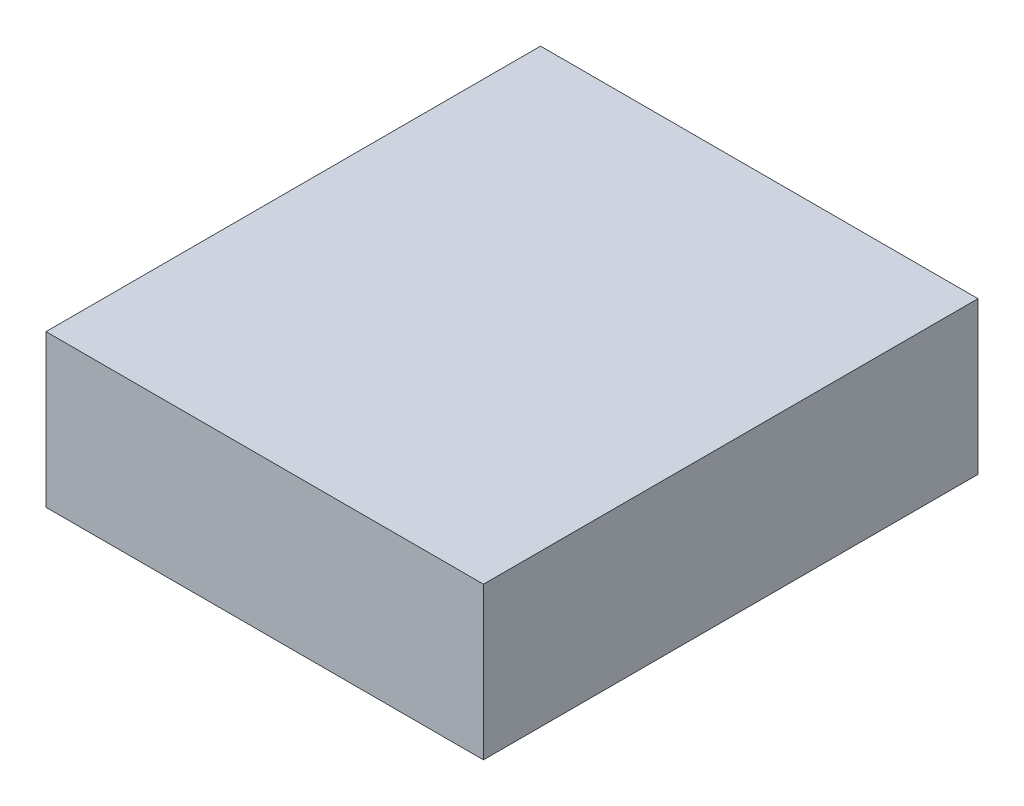
ISO-10303-21;
HEADER;
FILE_DESCRIPTION(('STEP AP214'),'2;1');
FILE_NAME('part.step','',(''),(''),'','','');
FILE_SCHEMA(('AUTOMOTIVE_DESIGN { 1 0 10303 214 1 1 1 1 }'));
ENDSEC;
DATA;
#1=APPLICATION_CONTEXT('core data for automotive mechanical design processes');
#2=APPLICATION_PROTOCOL_DEFINITION('international standard','automotive_design',2000,#1);
#3=PRODUCT_CONTEXT('',#1,'mechanical');
#4=PRODUCT('Part','Part','',(#3));
#5=PRODUCT_RELATED_PRODUCT_CATEGORY('part','',(#4));
#6=PRODUCT_DEFINITION_FORMATION('','',#4);
#7=PRODUCT_DEFINITION_CONTEXT('part definition',#1,'design');
#8=PRODUCT_DEFINITION('design','',#6,#7);
#9=PRODUCT_DEFINITION_SHAPE('','',#8);
#10=(LENGTH_UNIT() NAMED_UNIT(*) SI_UNIT(.MILLI.,.METRE.));
#11=(NAMED_UNIT(*) PLANE_ANGLE_UNIT() SI_UNIT($,.RADIAN.));
#12=(NAMED_UNIT(*) SI_UNIT($,.STERADIAN.) SOLID_ANGLE_UNIT());
#13=UNCERTAINTY_MEASURE_WITH_UNIT(LENGTH_MEASURE(1.E-05),#10,'distance_accuracy_value','');
#14=(GEOMETRIC_REPRESENTATION_CONTEXT(3) GLOBAL_UNCERTAINTY_ASSIGNED_CONTEXT((#13)) GLOBAL_UNIT_ASSIGNED_CONTEXT((#10,
#11,#12)) REPRESENTATION_CONTEXT('',''));
#15=CARTESIAN_POINT('',(0.,0.,0.));
#16=DIRECTION('',(0.,0.,1.));
#17=DIRECTION('',(1.,0.,0.));
#18=AXIS2_PLACEMENT_3D('',#15,#16,#17);
#19=CARTESIAN_POINT('',(0.,8.,0.));
#20=DIRECTION('',(1.,0.,0.));
#21=DIRECTION('',(0.,0.,-1.));
#22=AXIS2_PLACEMENT_3D('',#19,#20,#21);
#23=PLANE('',#22);
#24=DIRECTION('',(0.,0.,1.));
#25=VECTOR('',#24,1.);
#26=CARTESIAN_POINT('',(0.,0.,0.));
#27=LINE('',#26,#25);
#28=CARTESIAN_POINT('',(0.,0.,-26.));
#29=VERTEX_POINT('',#28);
#30=CARTESIAN_POINT('',(0.,0.,0.));
#31=VERTEX_POINT('',#30);
#32=EDGE_CURVE('E94',#29,#31,#27,.T.);
#33=ORIENTED_EDGE('',*,*,#32,.T.);
#34=DIRECTION('',(0.,-1.,0.));
#35=VECTOR('',#34,1.);
#36=CARTESIAN_POINT('',(0.,8.,0.));
#37=LINE('',#36,#35);
#38=CARTESIAN_POINT('',(0.,8.,0.));
#39=VERTEX_POINT('',#38);
#40=EDGE_CURVE('E11',#39,#31,#37,.T.);
#41=ORIENTED_EDGE('',*,*,#40,.F.);
#42=DIRECTION('',(0.,0.,1.));
#43=VECTOR('',#42,1.);
#44=CARTESIAN_POINT('',(0.,8.,0.));
#45=LINE('',#44,#43);
#46=CARTESIAN_POINT('',(0.,8.,-26.));
#47=VERTEX_POINT('',#46);
#48=EDGE_CURVE('E82',#47,#39,#45,.T.);
#49=ORIENTED_EDGE('',*,*,#48,.F.);
#50=DIRECTION('',(0.,-1.,0.));
#51=VECTOR('',#50,1.);
#52=CARTESIAN_POINT('',(0.,8.,-26.));
#53=LINE('',#52,#51);
#54=EDGE_CURVE('E90',#47,#29,#53,.T.);
#55=ORIENTED_EDGE('',*,*,#54,.T.);
#56=EDGE_LOOP('',(#33,#41,#49,#55));
#57=FACE_BOUND('',#56,.T.);
#58=ADVANCED_FACE('F31',(#57),#23,.F.);
#59=CARTESIAN_POINT('',(0.,8.,0.));
#60=DIRECTION('',(0.,0.,-1.));
#61=DIRECTION('',(-1.,0.,0.));
#62=AXIS2_PLACEMENT_3D('',#59,#60,#61);
#63=PLANE('',#62);
#64=DIRECTION('',(1.,0.,0.));
#65=VECTOR('',#64,1.);
#66=CARTESIAN_POINT('',(0.,0.,0.));
#67=LINE('',#66,#65);
#68=CARTESIAN_POINT('',(23.,0.,0.));
#69=VERTEX_POINT('',#68);
#70=EDGE_CURVE('E86',#31,#69,#67,.T.);
#71=ORIENTED_EDGE('',*,*,#70,.T.);
#72=DIRECTION('',(0.,-1.,0.));
#73=VECTOR('',#72,1.);
#74=CARTESIAN_POINT('',(23.,8.,0.));
#75=LINE('',#74,#73);
#76=CARTESIAN_POINT('',(23.,8.,0.));
#77=VERTEX_POINT('',#76);
#78=EDGE_CURVE('E39',#77,#69,#75,.T.);
#79=ORIENTED_EDGE('',*,*,#78,.F.);
#80=DIRECTION('',(1.,0.,0.));
#81=VECTOR('',#80,1.);
#82=CARTESIAN_POINT('',(0.,8.,0.));
#83=LINE('',#82,#81);
#84=EDGE_CURVE('E77',#39,#77,#83,.T.);
#85=ORIENTED_EDGE('',*,*,#84,.F.);
#86=ORIENTED_EDGE('',*,*,#40,.T.);
#87=EDGE_LOOP('',(#71,#79,#85,#86));
#88=FACE_BOUND('',#87,.T.);
#89=ADVANCED_FACE('F85',(#88),#63,.F.);
#90=CARTESIAN_POINT('',(23.,8.,0.));
#91=DIRECTION('',(-1.,0.,0.));
#92=DIRECTION('',(0.,0.,1.));
#93=AXIS2_PLACEMENT_3D('',#90,#91,#92);
#94=PLANE('',#93);
#95=DIRECTION('',(0.,0.,-1.));
#96=VECTOR('',#95,1.);
#97=CARTESIAN_POINT('',(23.,0.,0.));
#98=LINE('',#97,#96);
#99=CARTESIAN_POINT('',(23.,0.,-26.));
#100=VERTEX_POINT('',#99);
#101=EDGE_CURVE('E64',#69,#100,#98,.T.);
#102=ORIENTED_EDGE('',*,*,#101,.T.);
#103=DIRECTION('',(0.,-1.,0.));
#104=VECTOR('',#103,1.);
#105=CARTESIAN_POINT('',(23.,8.,-26.));
#106=LINE('',#105,#104);
#107=CARTESIAN_POINT('',(23.,8.,-26.));
#108=VERTEX_POINT('',#107);
#109=EDGE_CURVE('E87',#108,#100,#106,.T.);
#110=ORIENTED_EDGE('',*,*,#109,.F.);
#111=DIRECTION('',(0.,0.,-1.));
#112=VECTOR('',#111,1.);
#113=CARTESIAN_POINT('',(23.,8.,0.));
#114=LINE('',#113,#112);
#115=EDGE_CURVE('E80',#77,#108,#114,.T.);
#116=ORIENTED_EDGE('',*,*,#115,.F.);
#117=ORIENTED_EDGE('',*,*,#78,.T.);
#118=EDGE_LOOP('',(#102,#110,#116,#117));
#119=FACE_BOUND('',#118,.T.);
#120=ADVANCED_FACE('F88',(#119),#94,.F.);
#121=CARTESIAN_POINT('',(0.,8.,-26.));
#122=DIRECTION('',(0.,0.,1.));
#123=DIRECTION('',(1.,0.,0.));
#124=AXIS2_PLACEMENT_3D('',#121,#122,#123);
#125=PLANE('',#124);
#126=DIRECTION('',(-1.,0.,0.));
#127=VECTOR('',#126,1.);
#128=CARTESIAN_POINT('',(0.,0.,-26.));
#129=LINE('',#128,#127);
#130=EDGE_CURVE('E70',#100,#29,#129,.T.);
#131=ORIENTED_EDGE('',*,*,#130,.T.);
#132=ORIENTED_EDGE('',*,*,#54,.F.);
#133=DIRECTION('',(-1.,0.,0.));
#134=VECTOR('',#133,1.);
#135=CARTESIAN_POINT('',(0.,8.,-26.));
#136=LINE('',#135,#134);
#137=EDGE_CURVE('E47',#108,#47,#136,.T.);
#138=ORIENTED_EDGE('',*,*,#137,.F.);
#139=ORIENTED_EDGE('',*,*,#109,.T.);
#140=EDGE_LOOP('',(#131,#132,#138,#139));
#141=FACE_BOUND('',#140,.T.);
#142=ADVANCED_FACE('F101',(#141),#125,.F.);
#143=CARTESIAN_POINT('',(0.,8.,-26.));
#144=DIRECTION('',(0.,-1.,0.));
#145=DIRECTION('',(0.,0.,-1.));
#146=AXIS2_PLACEMENT_3D('',#143,#144,#145);
#147=PLANE('',#146);
#148=ORIENTED_EDGE('',*,*,#48,.T.);
#149=ORIENTED_EDGE('',*,*,#84,.T.);
#150=ORIENTED_EDGE('',*,*,#115,.T.);
#151=ORIENTED_EDGE('',*,*,#137,.T.);
#152=EDGE_LOOP('',(#148,#149,#150,#151));
#153=FACE_BOUND('',#152,.T.);
#154=ADVANCED_FACE('F78',(#153),#147,.F.);
#155=CARTESIAN_POINT('',(0.,0.,-26.));
#156=DIRECTION('',(0.,-1.,0.));
#157=DIRECTION('',(0.,0.,-1.));
#158=AXIS2_PLACEMENT_3D('',#155,#156,#157);
#159=PLANE('',#158);
#160=ORIENTED_EDGE('',*,*,#32,.F.);
#161=ORIENTED_EDGE('',*,*,#130,.F.);
#162=ORIENTED_EDGE('',*,*,#101,.F.);
#163=ORIENTED_EDGE('',*,*,#70,.F.);
#164=EDGE_LOOP('',(#160,#161,#162,#163));
#165=FACE_BOUND('',#164,.T.);
#166=ADVANCED_FACE('F104',(#165),#159,.T.);
#167=CLOSED_SHELL('',(#58,#89,#120,#142,#154,#166));
#168=MANIFOLD_SOLID_BREP('B2',#167);
#169=ADVANCED_BREP_SHAPE_REPRESENTATION('',(#18,#168),#14);
#170=SHAPE_DEFINITION_REPRESENTATION(#9,#169);
ENDSEC;
END-ISO-10303-21;
